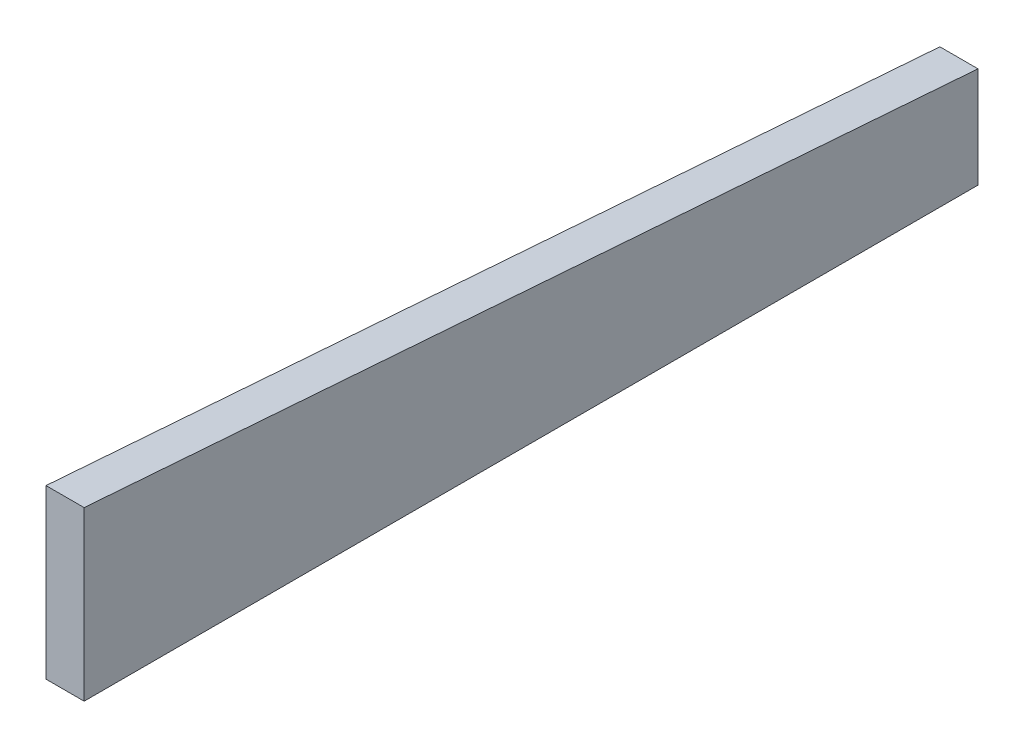
ISO-10303-21;
HEADER;
FILE_DESCRIPTION(('STEP AP214'),'2;1');
FILE_NAME('part.step','',(''),(''),'','','');
FILE_SCHEMA(('AUTOMOTIVE_DESIGN { 1 0 10303 214 1 1 1 1 }'));
ENDSEC;
DATA;
#1=APPLICATION_CONTEXT('core data for automotive mechanical design processes');
#2=APPLICATION_PROTOCOL_DEFINITION('international standard','automotive_design',2000,#1);
#3=PRODUCT_CONTEXT('',#1,'mechanical');
#4=PRODUCT('Part','Part','',(#3));
#5=PRODUCT_RELATED_PRODUCT_CATEGORY('part','',(#4));
#6=PRODUCT_DEFINITION_FORMATION('','',#4);
#7=PRODUCT_DEFINITION_CONTEXT('part definition',#1,'design');
#8=PRODUCT_DEFINITION('design','',#6,#7);
#9=PRODUCT_DEFINITION_SHAPE('','',#8);
#10=(LENGTH_UNIT() NAMED_UNIT(*) SI_UNIT(.MILLI.,.METRE.));
#11=(NAMED_UNIT(*) PLANE_ANGLE_UNIT() SI_UNIT($,.RADIAN.));
#12=(NAMED_UNIT(*) SI_UNIT($,.STERADIAN.) SOLID_ANGLE_UNIT());
#13=UNCERTAINTY_MEASURE_WITH_UNIT(LENGTH_MEASURE(1.E-05),#10,'distance_accuracy_value','');
#14=(GEOMETRIC_REPRESENTATION_CONTEXT(3) GLOBAL_UNCERTAINTY_ASSIGNED_CONTEXT((#13)) GLOBAL_UNIT_ASSIGNED_CONTEXT((#10,
#11,#12)) REPRESENTATION_CONTEXT('',''));
#15=CARTESIAN_POINT('',(0.,0.,0.));
#16=DIRECTION('',(0.,0.,1.));
#17=DIRECTION('',(1.,0.,0.));
#18=AXIS2_PLACEMENT_3D('',#15,#16,#17);
#19=CARTESIAN_POINT('',(3.5814,-15.748,0.));
#20=DIRECTION('',(0.,0.,-1.));
#21=DIRECTION('',(-1.,0.,0.));
#22=AXIS2_PLACEMENT_3D('',#19,#20,#21);
#23=PLANE('',#22);
#24=DIRECTION('',(0.,-1.,0.));
#25=VECTOR('',#24,1.);
#26=CARTESIAN_POINT('',(0.,-15.748,0.));
#27=LINE('',#26,#25);
#28=CARTESIAN_POINT('',(0.,0.,0.));
#29=VERTEX_POINT('',#28);
#30=CARTESIAN_POINT('',(0.,-15.748,0.));
#31=VERTEX_POINT('',#30);
#32=EDGE_CURVE('E101',#29,#31,#27,.T.);
#33=ORIENTED_EDGE('',*,*,#32,.T.);
#34=DIRECTION('',(-1.,0.,0.));
#35=VECTOR('',#34,1.);
#36=CARTESIAN_POINT('',(3.5814,-15.748,0.));
#37=LINE('',#36,#35);
#38=CARTESIAN_POINT('',(3.5814,-15.748,0.));
#39=VERTEX_POINT('',#38);
#40=EDGE_CURVE('E11',#39,#31,#37,.T.);
#41=ORIENTED_EDGE('',*,*,#40,.F.);
#42=DIRECTION('',(0.,-1.,0.));
#43=VECTOR('',#42,1.);
#44=CARTESIAN_POINT('',(3.5814,-15.748,0.));
#45=LINE('',#44,#43);
#46=CARTESIAN_POINT('',(3.5814,0.,0.));
#47=VERTEX_POINT('',#46);
#48=EDGE_CURVE('E89',#47,#39,#45,.T.);
#49=ORIENTED_EDGE('',*,*,#48,.F.);
#50=DIRECTION('',(-1.,0.,0.));
#51=VECTOR('',#50,1.);
#52=CARTESIAN_POINT('',(3.5814,0.,0.));
#53=LINE('',#52,#51);
#54=EDGE_CURVE('E97',#47,#29,#53,.T.);
#55=ORIENTED_EDGE('',*,*,#54,.T.);
#56=EDGE_LOOP('',(#33,#41,#49,#55));
#57=FACE_BOUND('',#56,.T.);
#58=ADVANCED_FACE('F38',(#57),#23,.F.);
#59=CARTESIAN_POINT('',(3.5814,-15.748,-83.947));
#60=DIRECTION('',(0.,1.,0.));
#61=DIRECTION('',(0.,0.,1.));
#62=AXIS2_PLACEMENT_3D('',#59,#60,#61);
#63=PLANE('',#62);
#64=DIRECTION('',(0.,0.,-1.));
#65=VECTOR('',#64,1.);
#66=CARTESIAN_POINT('',(0.,-15.748,-83.947));
#67=LINE('',#66,#65);
#68=CARTESIAN_POINT('',(0.,-15.748,-83.947));
#69=VERTEX_POINT('',#68);
#70=EDGE_CURVE('E93',#31,#69,#67,.T.);
#71=ORIENTED_EDGE('',*,*,#70,.T.);
#72=DIRECTION('',(-1.,0.,0.));
#73=VECTOR('',#72,1.);
#74=CARTESIAN_POINT('',(3.5814,-15.748,-83.947));
#75=LINE('',#74,#73);
#76=CARTESIAN_POINT('',(3.5814,-15.748,-83.947));
#77=VERTEX_POINT('',#76);
#78=EDGE_CURVE('E46',#77,#69,#75,.T.);
#79=ORIENTED_EDGE('',*,*,#78,.F.);
#80=DIRECTION('',(0.,0.,-1.));
#81=VECTOR('',#80,1.);
#82=CARTESIAN_POINT('',(3.5814,-15.748,-83.947));
#83=LINE('',#82,#81);
#84=EDGE_CURVE('E84',#39,#77,#83,.T.);
#85=ORIENTED_EDGE('',*,*,#84,.F.);
#86=ORIENTED_EDGE('',*,*,#40,.T.);
#87=EDGE_LOOP('',(#71,#79,#85,#86));
#88=FACE_BOUND('',#87,.T.);
#89=ADVANCED_FACE('F92',(#88),#63,.F.);
#90=CARTESIAN_POINT('',(3.5814,-6.28649999999999,-83.947));
#91=DIRECTION('',(0.,0.,1.));
#92=DIRECTION('',(1.,0.,0.));
#93=AXIS2_PLACEMENT_3D('',#90,#91,#92);
#94=PLANE('',#93);
#95=DIRECTION('',(0.,1.,0.));
#96=VECTOR('',#95,1.);
#97=CARTESIAN_POINT('',(0.,-6.28649999999999,-83.947));
#98=LINE('',#97,#96);
#99=CARTESIAN_POINT('',(0.,-6.28649999999999,-83.947));
#100=VERTEX_POINT('',#99);
#101=EDGE_CURVE('E71',#69,#100,#98,.T.);
#102=ORIENTED_EDGE('',*,*,#101,.T.);
#103=DIRECTION('',(-1.,0.,0.));
#104=VECTOR('',#103,1.);
#105=CARTESIAN_POINT('',(3.5814,-6.28649999999999,-83.947));
#106=LINE('',#105,#104);
#107=CARTESIAN_POINT('',(3.5814,-6.28649999999999,-83.947));
#108=VERTEX_POINT('',#107);
#109=EDGE_CURVE('E94',#108,#100,#106,.T.);
#110=ORIENTED_EDGE('',*,*,#109,.F.);
#111=DIRECTION('',(0.,1.,0.));
#112=VECTOR('',#111,1.);
#113=CARTESIAN_POINT('',(3.5814,-6.28649999999999,-83.947));
#114=LINE('',#113,#112);
#115=EDGE_CURVE('E87',#77,#108,#114,.T.);
#116=ORIENTED_EDGE('',*,*,#115,.F.);
#117=ORIENTED_EDGE('',*,*,#78,.T.);
#118=EDGE_LOOP('',(#102,#110,#116,#117));
#119=FACE_BOUND('',#118,.T.);
#120=ADVANCED_FACE('F95',(#119),#94,.F.);
#121=CARTESIAN_POINT('',(3.5814,0.,0.));
#122=DIRECTION('',(0.,-0.99720774214568,0.0746774330351151));
#123=DIRECTION('',(0.,-0.0746774330351151,-0.99720774214568));
#124=AXIS2_PLACEMENT_3D('',#121,#122,#123);
#125=PLANE('',#124);
#126=DIRECTION('',(0.,0.0746774330351151,0.997207742145681));
#127=VECTOR('',#126,1.);
#128=CARTESIAN_POINT('',(0.,0.,0.));
#129=LINE('',#128,#127);
#130=EDGE_CURVE('E77',#100,#29,#129,.T.);
#131=ORIENTED_EDGE('',*,*,#130,.T.);
#132=ORIENTED_EDGE('',*,*,#54,.F.);
#133=DIRECTION('',(0.,0.0746774330351151,0.997207742145681));
#134=VECTOR('',#133,1.);
#135=CARTESIAN_POINT('',(3.5814,0.,0.));
#136=LINE('',#135,#134);
#137=EDGE_CURVE('E54',#108,#47,#136,.T.);
#138=ORIENTED_EDGE('',*,*,#137,.F.);
#139=ORIENTED_EDGE('',*,*,#109,.T.);
#140=EDGE_LOOP('',(#131,#132,#138,#139));
#141=FACE_BOUND('',#140,.T.);
#142=ADVANCED_FACE('F108',(#141),#125,.F.);
#143=CARTESIAN_POINT('',(3.5814,0.,0.));
#144=DIRECTION('',(1.,0.,0.));
#145=DIRECTION('',(0.,0.,-1.));
#146=AXIS2_PLACEMENT_3D('',#143,#144,#145);
#147=PLANE('',#146);
#148=ORIENTED_EDGE('',*,*,#48,.T.);
#149=ORIENTED_EDGE('',*,*,#84,.T.);
#150=ORIENTED_EDGE('',*,*,#115,.T.);
#151=ORIENTED_EDGE('',*,*,#137,.T.);
#152=EDGE_LOOP('',(#148,#149,#150,#151));
#153=FACE_BOUND('',#152,.T.);
#154=ADVANCED_FACE('F85',(#153),#147,.T.);
#155=CARTESIAN_POINT('',(0.,0.,0.));
#156=DIRECTION('',(1.,0.,0.));
#157=DIRECTION('',(0.,0.,-1.));
#158=AXIS2_PLACEMENT_3D('',#155,#156,#157);
#159=PLANE('',#158);
#160=ORIENTED_EDGE('',*,*,#32,.F.);
#161=ORIENTED_EDGE('',*,*,#130,.F.);
#162=ORIENTED_EDGE('',*,*,#101,.F.);
#163=ORIENTED_EDGE('',*,*,#70,.F.);
#164=EDGE_LOOP('',(#160,#161,#162,#163));
#165=FACE_BOUND('',#164,.T.);
#166=ADVANCED_FACE('F111',(#165),#159,.F.);
#167=CLOSED_SHELL('',(#58,#89,#120,#142,#154,#166));
#168=MANIFOLD_SOLID_BREP('B2',#167);
#169=ADVANCED_BREP_SHAPE_REPRESENTATION('',(#18,#168),#14);
#170=SHAPE_DEFINITION_REPRESENTATION(#9,#169);
ENDSEC;
END-ISO-10303-21;
